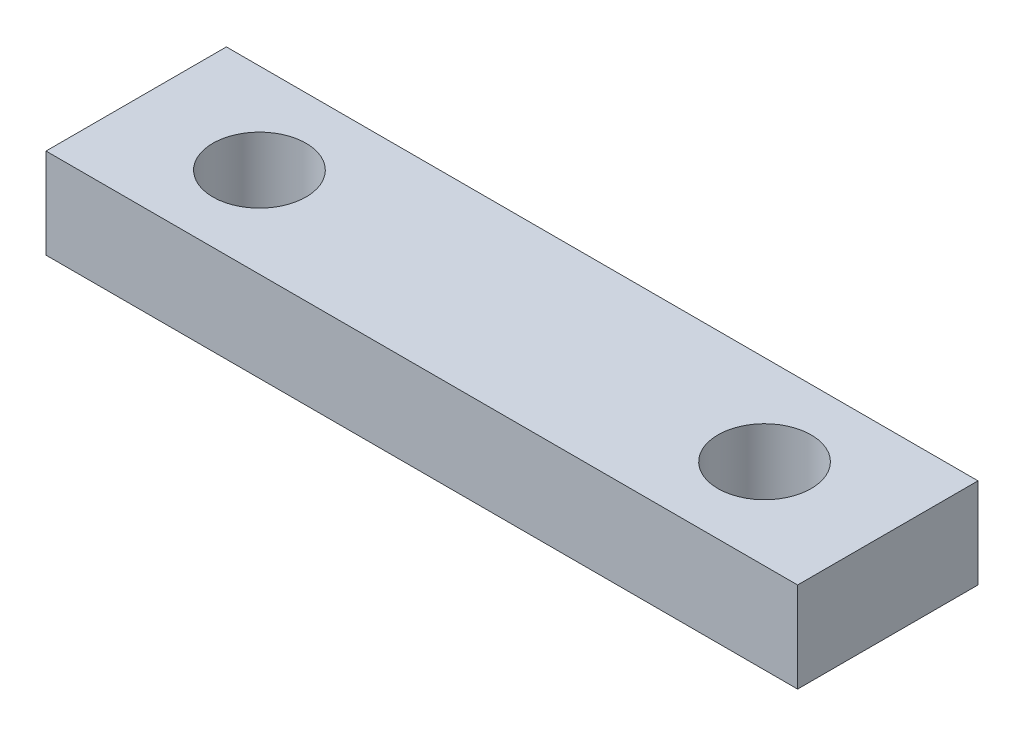
ISO-10303-21;
HEADER;
FILE_DESCRIPTION(('STEP AP214'),'2;1');
FILE_NAME('part.step','',(''),(''),'','','');
FILE_SCHEMA(('AUTOMOTIVE_DESIGN { 1 0 10303 214 1 1 1 1 }'));
ENDSEC;
DATA;
#1=APPLICATION_CONTEXT('core data for automotive mechanical design processes');
#2=APPLICATION_PROTOCOL_DEFINITION('international standard','automotive_design',2000,#1);
#3=PRODUCT_CONTEXT('',#1,'mechanical');
#4=PRODUCT('Part','Part','',(#3));
#5=PRODUCT_RELATED_PRODUCT_CATEGORY('part','',(#4));
#6=PRODUCT_DEFINITION_FORMATION('','',#4);
#7=PRODUCT_DEFINITION_CONTEXT('part definition',#1,'design');
#8=PRODUCT_DEFINITION('design','',#6,#7);
#9=PRODUCT_DEFINITION_SHAPE('','',#8);
#10=(LENGTH_UNIT() NAMED_UNIT(*) SI_UNIT(.MILLI.,.METRE.));
#11=(NAMED_UNIT(*) PLANE_ANGLE_UNIT() SI_UNIT($,.RADIAN.));
#12=(NAMED_UNIT(*) SI_UNIT($,.STERADIAN.) SOLID_ANGLE_UNIT());
#13=UNCERTAINTY_MEASURE_WITH_UNIT(LENGTH_MEASURE(1.E-05),#10,'distance_accuracy_value','');
#14=(GEOMETRIC_REPRESENTATION_CONTEXT(3) GLOBAL_UNCERTAINTY_ASSIGNED_CONTEXT((#13)) GLOBAL_UNIT_ASSIGNED_CONTEXT((#10,
#11,#12)) REPRESENTATION_CONTEXT('',''));
#15=CARTESIAN_POINT('',(0.,0.,0.));
#16=DIRECTION('',(0.,0.,1.));
#17=DIRECTION('',(1.,0.,0.));
#18=AXIS2_PLACEMENT_3D('',#15,#16,#17);
#19=CARTESIAN_POINT('',(0.,3.,0.));
#20=DIRECTION('',(0.,1.,0.));
#21=DIRECTION('',(0.,0.,1.));
#22=AXIS2_PLACEMENT_3D('',#19,#20,#21);
#23=PLANE('',#22);
#24=CARTESIAN_POINT('',(-8.4,3.,0.));
#25=DIRECTION('',(0.,1.,0.));
#26=DIRECTION('',(0.,0.,1.));
#27=AXIS2_PLACEMENT_3D('',#24,#25,#26);
#28=CIRCLE('',#27,1.55);
#29=CARTESIAN_POINT('',(-8.4,3.,1.55));
#30=VERTEX_POINT('',#29);
#31=EDGE_CURVE('E112',#30,#30,#28,.T.);
#32=ORIENTED_EDGE('',*,*,#31,.F.);
#33=EDGE_LOOP('',(#32));
#34=FACE_BOUND('',#33,.T.);
#35=DIRECTION('',(0.,0.,-1.));
#36=VECTOR('',#35,1.);
#37=CARTESIAN_POINT('',(12.5,3.,-3.));
#38=LINE('',#37,#36);
#39=CARTESIAN_POINT('',(12.5,3.,3.));
#40=VERTEX_POINT('',#39);
#41=CARTESIAN_POINT('',(12.5,3.,-3.));
#42=VERTEX_POINT('',#41);
#43=EDGE_CURVE('E92',#40,#42,#38,.T.);
#44=ORIENTED_EDGE('',*,*,#43,.T.);
#45=DIRECTION('',(-1.,0.,0.));
#46=VECTOR('',#45,1.);
#47=CARTESIAN_POINT('',(-12.5,3.,-3.));
#48=LINE('',#47,#46);
#49=CARTESIAN_POINT('',(-12.5,3.,-3.));
#50=VERTEX_POINT('',#49);
#51=EDGE_CURVE('E87',#42,#50,#48,.T.);
#52=ORIENTED_EDGE('',*,*,#51,.T.);
#53=DIRECTION('',(0.,0.,1.));
#54=VECTOR('',#53,1.);
#55=CARTESIAN_POINT('',(-12.5,3.,-3.));
#56=LINE('',#55,#54);
#57=CARTESIAN_POINT('',(-12.5,3.,3.));
#58=VERTEX_POINT('',#57);
#59=EDGE_CURVE('E90',#50,#58,#56,.T.);
#60=ORIENTED_EDGE('',*,*,#59,.T.);
#61=DIRECTION('',(1.,0.,0.));
#62=VECTOR('',#61,1.);
#63=CARTESIAN_POINT('',(-12.5,3.,3.));
#64=LINE('',#63,#62);
#65=EDGE_CURVE('E57',#58,#40,#64,.T.);
#66=ORIENTED_EDGE('',*,*,#65,.T.);
#67=EDGE_LOOP('',(#44,#52,#60,#66));
#68=FACE_BOUND('',#67,.T.);
#69=CARTESIAN_POINT('',(8.4,3.,0.));
#70=DIRECTION('',(0.,1.,0.));
#71=DIRECTION('',(0.,0.,1.));
#72=AXIS2_PLACEMENT_3D('',#69,#70,#71);
#73=CIRCLE('',#72,1.55);
#74=CARTESIAN_POINT('',(8.4,3.,1.55));
#75=VERTEX_POINT('',#74);
#76=EDGE_CURVE('E134',#75,#75,#73,.T.);
#77=ORIENTED_EDGE('',*,*,#76,.F.);
#78=EDGE_LOOP('',(#77));
#79=FACE_BOUND('',#78,.T.);
#80=ADVANCED_FACE('F39',(#34,#68,#79),#23,.T.);
#81=CARTESIAN_POINT('',(0.,0.,0.));
#82=DIRECTION('',(0.,1.,0.));
#83=DIRECTION('',(0.,0.,1.));
#84=AXIS2_PLACEMENT_3D('',#81,#82,#83);
#85=PLANE('',#84);
#86=DIRECTION('',(0.,0.,-1.));
#87=VECTOR('',#86,1.);
#88=CARTESIAN_POINT('',(12.5,0.,-3.));
#89=LINE('',#88,#87);
#90=CARTESIAN_POINT('',(12.5,0.,3.));
#91=VERTEX_POINT('',#90);
#92=CARTESIAN_POINT('',(12.5,0.,-3.));
#93=VERTEX_POINT('',#92);
#94=EDGE_CURVE('E108',#91,#93,#89,.T.);
#95=ORIENTED_EDGE('',*,*,#94,.F.);
#96=DIRECTION('',(1.,0.,0.));
#97=VECTOR('',#96,1.);
#98=CARTESIAN_POINT('',(-12.5,0.,3.));
#99=LINE('',#98,#97);
#100=CARTESIAN_POINT('',(-12.5,0.,3.));
#101=VERTEX_POINT('',#100);
#102=EDGE_CURVE('E80',#101,#91,#99,.T.);
#103=ORIENTED_EDGE('',*,*,#102,.F.);
#104=DIRECTION('',(0.,0.,1.));
#105=VECTOR('',#104,1.);
#106=CARTESIAN_POINT('',(-12.5,0.,-3.));
#107=LINE('',#106,#105);
#108=CARTESIAN_POINT('',(-12.5,0.,-3.));
#109=VERTEX_POINT('',#108);
#110=EDGE_CURVE('E74',#109,#101,#107,.T.);
#111=ORIENTED_EDGE('',*,*,#110,.F.);
#112=DIRECTION('',(-1.,0.,0.));
#113=VECTOR('',#112,1.);
#114=CARTESIAN_POINT('',(-12.5,0.,-3.));
#115=LINE('',#114,#113);
#116=EDGE_CURVE('E97',#93,#109,#115,.T.);
#117=ORIENTED_EDGE('',*,*,#116,.F.);
#118=EDGE_LOOP('',(#95,#103,#111,#117));
#119=FACE_BOUND('',#118,.T.);
#120=CARTESIAN_POINT('',(-8.4,0.,0.));
#121=DIRECTION('',(0.,1.,0.));
#122=DIRECTION('',(0.,0.,1.));
#123=AXIS2_PLACEMENT_3D('',#120,#121,#122);
#124=CIRCLE('',#123,1.55);
#125=CARTESIAN_POINT('',(-8.4,0.,1.55));
#126=VERTEX_POINT('',#125);
#127=EDGE_CURVE('E130',#126,#126,#124,.T.);
#128=ORIENTED_EDGE('',*,*,#127,.T.);
#129=EDGE_LOOP('',(#128));
#130=FACE_BOUND('',#129,.T.);
#131=CARTESIAN_POINT('',(8.4,0.,0.));
#132=DIRECTION('',(0.,1.,0.));
#133=DIRECTION('',(0.,0.,1.));
#134=AXIS2_PLACEMENT_3D('',#131,#132,#133);
#135=CIRCLE('',#134,1.55);
#136=CARTESIAN_POINT('',(8.4,0.,1.55));
#137=VERTEX_POINT('',#136);
#138=EDGE_CURVE('E138',#137,#137,#135,.T.);
#139=ORIENTED_EDGE('',*,*,#138,.T.);
#140=EDGE_LOOP('',(#139));
#141=FACE_BOUND('',#140,.T.);
#142=ADVANCED_FACE('F125',(#119,#130,#141),#85,.F.);
#143=CARTESIAN_POINT('',(12.5,3.,-3.));
#144=DIRECTION('',(-1.,0.,0.));
#145=DIRECTION('',(0.,0.,1.));
#146=AXIS2_PLACEMENT_3D('',#143,#144,#145);
#147=PLANE('',#146);
#148=ORIENTED_EDGE('',*,*,#94,.T.);
#149=DIRECTION('',(0.,-1.,0.));
#150=VECTOR('',#149,1.);
#151=CARTESIAN_POINT('',(12.5,3.,-3.));
#152=LINE('',#151,#150);
#153=EDGE_CURVE('E11',#42,#93,#152,.T.);
#154=ORIENTED_EDGE('',*,*,#153,.F.);
#155=ORIENTED_EDGE('',*,*,#43,.F.);
#156=DIRECTION('',(0.,-1.,0.));
#157=VECTOR('',#156,1.);
#158=CARTESIAN_POINT('',(12.5,3.,3.));
#159=LINE('',#158,#157);
#160=EDGE_CURVE('E104',#40,#91,#159,.T.);
#161=ORIENTED_EDGE('',*,*,#160,.T.);
#162=EDGE_LOOP('',(#148,#154,#155,#161));
#163=FACE_BOUND('',#162,.T.);
#164=ADVANCED_FACE('F41',(#163),#147,.F.);
#165=CARTESIAN_POINT('',(-12.5,3.,-3.));
#166=DIRECTION('',(0.,0.,1.));
#167=DIRECTION('',(1.,0.,0.));
#168=AXIS2_PLACEMENT_3D('',#165,#166,#167);
#169=PLANE('',#168);
#170=ORIENTED_EDGE('',*,*,#116,.T.);
#171=DIRECTION('',(0.,-1.,0.));
#172=VECTOR('',#171,1.);
#173=CARTESIAN_POINT('',(-12.5,3.,-3.));
#174=LINE('',#173,#172);
#175=EDGE_CURVE('E49',#50,#109,#174,.T.);
#176=ORIENTED_EDGE('',*,*,#175,.F.);
#177=ORIENTED_EDGE('',*,*,#51,.F.);
#178=ORIENTED_EDGE('',*,*,#153,.T.);
#179=EDGE_LOOP('',(#170,#176,#177,#178));
#180=FACE_BOUND('',#179,.T.);
#181=ADVANCED_FACE('F96',(#180),#169,.F.);
#182=CARTESIAN_POINT('',(-12.5,3.,-3.));
#183=DIRECTION('',(1.,0.,0.));
#184=DIRECTION('',(0.,0.,-1.));
#185=AXIS2_PLACEMENT_3D('',#182,#183,#184);
#186=PLANE('',#185);
#187=ORIENTED_EDGE('',*,*,#110,.T.);
#188=DIRECTION('',(0.,-1.,0.));
#189=VECTOR('',#188,1.);
#190=CARTESIAN_POINT('',(-12.5,3.,3.));
#191=LINE('',#190,#189);
#192=EDGE_CURVE('E99',#58,#101,#191,.T.);
#193=ORIENTED_EDGE('',*,*,#192,.F.);
#194=ORIENTED_EDGE('',*,*,#59,.F.);
#195=ORIENTED_EDGE('',*,*,#175,.T.);
#196=EDGE_LOOP('',(#187,#193,#194,#195));
#197=FACE_BOUND('',#196,.T.);
#198=ADVANCED_FACE('F100',(#197),#186,.F.);
#199=CARTESIAN_POINT('',(-12.5,3.,3.));
#200=DIRECTION('',(0.,0.,-1.));
#201=DIRECTION('',(-1.,0.,0.));
#202=AXIS2_PLACEMENT_3D('',#199,#200,#201);
#203=PLANE('',#202);
#204=ORIENTED_EDGE('',*,*,#102,.T.);
#205=ORIENTED_EDGE('',*,*,#160,.F.);
#206=ORIENTED_EDGE('',*,*,#65,.F.);
#207=ORIENTED_EDGE('',*,*,#192,.T.);
#208=EDGE_LOOP('',(#204,#205,#206,#207));
#209=FACE_BOUND('',#208,.T.);
#210=ADVANCED_FACE('F122',(#209),#203,.F.);
#211=CARTESIAN_POINT('',(-8.4,3.,0.));
#212=DIRECTION('',(0.,-1.,0.));
#213=DIRECTION('',(0.,0.,-1.));
#214=AXIS2_PLACEMENT_3D('',#211,#212,#213);
#215=CYLINDRICAL_SURFACE('',#214,1.55);
#216=ORIENTED_EDGE('',*,*,#31,.T.);
#217=EDGE_LOOP('',(#216));
#218=FACE_BOUND('',#217,.T.);
#219=ORIENTED_EDGE('',*,*,#127,.F.);
#220=EDGE_LOOP('',(#219));
#221=FACE_BOUND('',#220,.T.);
#222=ADVANCED_FACE('F157',(#218,#221),#215,.F.);
#223=CARTESIAN_POINT('',(8.4,3.,0.));
#224=DIRECTION('',(0.,-1.,0.));
#225=DIRECTION('',(0.,0.,-1.));
#226=AXIS2_PLACEMENT_3D('',#223,#224,#225);
#227=CYLINDRICAL_SURFACE('',#226,1.55);
#228=ORIENTED_EDGE('',*,*,#76,.T.);
#229=EDGE_LOOP('',(#228));
#230=FACE_BOUND('',#229,.T.);
#231=ORIENTED_EDGE('',*,*,#138,.F.);
#232=EDGE_LOOP('',(#231));
#233=FACE_BOUND('',#232,.T.);
#234=ADVANCED_FACE('F146',(#230,#233),#227,.F.);
#235=CLOSED_SHELL('',(#80,#142,#164,#181,#198,#210,#222,#234));
#236=MANIFOLD_SOLID_BREP('B2',#235);
#237=ADVANCED_BREP_SHAPE_REPRESENTATION('',(#18,#236),#14);
#238=SHAPE_DEFINITION_REPRESENTATION(#9,#237);
ENDSEC;
END-ISO-10303-21;
